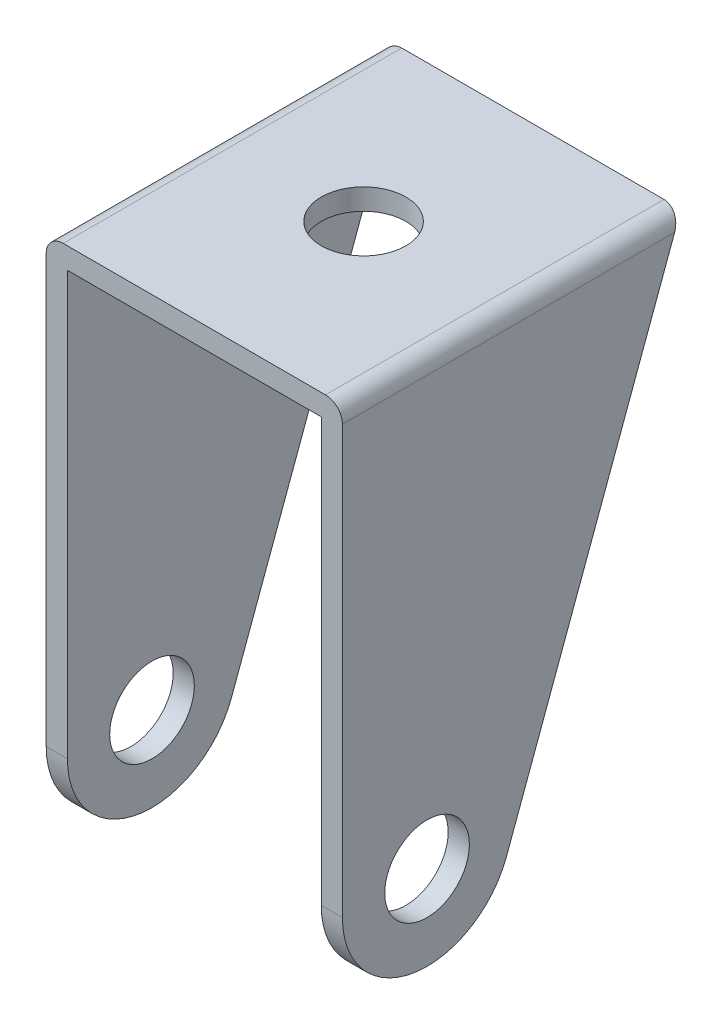
ISO-10303-21;
HEADER;
FILE_DESCRIPTION(('STEP AP214'),'2;1');
FILE_NAME('part.step','',(''),(''),'','','');
FILE_SCHEMA(('AUTOMOTIVE_DESIGN { 1 0 10303 214 1 1 1 1 }'));
ENDSEC;
DATA;
#1=APPLICATION_CONTEXT('core data for automotive mechanical design processes');
#2=APPLICATION_PROTOCOL_DEFINITION('international standard','automotive_design',2000,#1);
#3=PRODUCT_CONTEXT('',#1,'mechanical');
#4=PRODUCT('Part','Part','',(#3));
#5=PRODUCT_RELATED_PRODUCT_CATEGORY('part','',(#4));
#6=PRODUCT_DEFINITION_FORMATION('','',#4);
#7=PRODUCT_DEFINITION_CONTEXT('part definition',#1,'design');
#8=PRODUCT_DEFINITION('design','',#6,#7);
#9=PRODUCT_DEFINITION_SHAPE('','',#8);
#10=(LENGTH_UNIT() NAMED_UNIT(*) SI_UNIT(.MILLI.,.METRE.));
#11=(NAMED_UNIT(*) PLANE_ANGLE_UNIT() SI_UNIT($,.RADIAN.));
#12=(NAMED_UNIT(*) SI_UNIT($,.STERADIAN.) SOLID_ANGLE_UNIT());
#13=UNCERTAINTY_MEASURE_WITH_UNIT(LENGTH_MEASURE(1.E-05),#10,'distance_accuracy_value','');
#14=(GEOMETRIC_REPRESENTATION_CONTEXT(3) GLOBAL_UNCERTAINTY_ASSIGNED_CONTEXT((#13)) GLOBAL_UNIT_ASSIGNED_CONTEXT((#10,
#11,#12)) REPRESENTATION_CONTEXT('',''));
#15=CARTESIAN_POINT('',(0.,0.,0.));
#16=DIRECTION('',(0.,0.,1.));
#17=DIRECTION('',(1.,0.,0.));
#18=AXIS2_PLACEMENT_3D('',#15,#16,#17);
#19=CARTESIAN_POINT('',(0.,0.,50.8));
#20=DIRECTION('',(-1.,0.,0.));
#21=DIRECTION('',(0.,0.,1.));
#22=AXIS2_PLACEMENT_3D('',#19,#20,#21);
#23=PLANE('',#22);
#24=CARTESIAN_POINT('',(0.,12.7,38.1));
#25=DIRECTION('',(-1.,0.,0.));
#26=DIRECTION('',(0.,0.,1.));
#27=AXIS2_PLACEMENT_3D('',#24,#25,#26);
#28=CIRCLE('',#27,6.35);
#29=CARTESIAN_POINT('',(0.,12.7,44.45));
#30=VERTEX_POINT('',#29);
#31=EDGE_CURVE('E158',#30,#30,#28,.T.);
#32=ORIENTED_EDGE('',*,*,#31,.T.);
#33=EDGE_LOOP('',(#32));
#34=FACE_BOUND('',#33,.T.);
#35=CARTESIAN_POINT('',(0.,12.7,38.1));
#36=DIRECTION('',(-1.,0.,0.));
#37=DIRECTION('',(0.,0.,1.));
#38=AXIS2_PLACEMENT_3D('',#35,#36,#37);
#39=CIRCLE('',#38,12.7);
#40=CARTESIAN_POINT('',(0.,12.7,50.8));
#41=VERTEX_POINT('',#40);
#42=CARTESIAN_POINT('',(0.,8.30938963643764,26.1830985304325));
#43=VERTEX_POINT('',#42);
#44=EDGE_CURVE('E190',#41,#43,#39,.F.);
#45=ORIENTED_EDGE('',*,*,#44,.T.);
#46=DIRECTION('',(0.,0.938338698391138,-0.345717351461603));
#47=VECTOR('',#46,1.);
#48=CARTESIAN_POINT('',(0.,-6.99257979105945,31.8208883303109));
#49=LINE('',#48,#47);
#50=CARTESIAN_POINT('',(0.,76.2,1.1697829288855));
#51=VERTEX_POINT('',#50);
#52=EDGE_CURVE('E176',#43,#51,#49,.T.);
#53=ORIENTED_EDGE('',*,*,#52,.T.);
#54=DIRECTION('',(0.,0.,-1.));
#55=VECTOR('',#54,1.);
#56=CARTESIAN_POINT('',(0.,76.2,50.8));
#57=LINE('',#56,#55);
#58=CARTESIAN_POINT('',(0.,76.2,50.8));
#59=VERTEX_POINT('',#58);
#60=EDGE_CURVE('E210',#59,#51,#57,.T.);
#61=ORIENTED_EDGE('',*,*,#60,.F.);
#62=DIRECTION('',(0.,1.,0.));
#63=VECTOR('',#62,1.);
#64=CARTESIAN_POINT('',(0.,0.,50.8));
#65=LINE('',#64,#63);
#66=EDGE_CURVE('E193',#41,#59,#65,.T.);
#67=ORIENTED_EDGE('',*,*,#66,.F.);
#68=EDGE_LOOP('',(#45,#53,#61,#67));
#69=FACE_BOUND('',#68,.T.);
#70=ADVANCED_FACE('F63',(#34,#69),#23,.F.);
#71=CARTESIAN_POINT('',(38.1,76.2,50.8));
#72=DIRECTION('',(1.,0.,0.));
#73=DIRECTION('',(0.,1.,0.));
#74=AXIS2_PLACEMENT_3D('',#71,#72,#73);
#75=PLANE('',#74);
#76=CARTESIAN_POINT('',(38.1,12.7,38.1));
#77=DIRECTION('',(1.,0.,0.));
#78=DIRECTION('',(0.,1.,0.));
#79=AXIS2_PLACEMENT_3D('',#76,#77,#78);
#80=CIRCLE('',#79,6.35);
#81=CARTESIAN_POINT('',(38.1,19.05,38.1));
#82=VERTEX_POINT('',#81);
#83=EDGE_CURVE('E182',#82,#82,#80,.T.);
#84=ORIENTED_EDGE('',*,*,#83,.T.);
#85=EDGE_LOOP('',(#84));
#86=FACE_BOUND('',#85,.T.);
#87=DIRECTION('',(0.,0.,-1.));
#88=VECTOR('',#87,1.);
#89=CARTESIAN_POINT('',(38.1,76.2,50.8));
#90=LINE('',#89,#88);
#91=CARTESIAN_POINT('',(38.1,76.2,50.8));
#92=VERTEX_POINT('',#91);
#93=CARTESIAN_POINT('',(38.1,76.2,1.1697829288855));
#94=VERTEX_POINT('',#93);
#95=EDGE_CURVE('E205',#92,#94,#90,.T.);
#96=ORIENTED_EDGE('',*,*,#95,.T.);
#97=DIRECTION('',(0.,-0.938338698391138,0.345717351461603));
#98=VECTOR('',#97,1.);
#99=CARTESIAN_POINT('',(38.1,60.0999590917967,7.10161064818449));
#100=LINE('',#99,#98);
#101=CARTESIAN_POINT('',(38.1,8.30938963643765,26.1830985304325));
#102=VERTEX_POINT('',#101);
#103=EDGE_CURVE('E174',#94,#102,#100,.T.);
#104=ORIENTED_EDGE('',*,*,#103,.T.);
#105=CARTESIAN_POINT('',(38.1,12.7,38.1));
#106=DIRECTION('',(1.,0.,0.));
#107=DIRECTION('',(0.,1.,0.));
#108=AXIS2_PLACEMENT_3D('',#105,#106,#107);
#109=CIRCLE('',#108,12.7);
#110=CARTESIAN_POINT('',(38.1,12.7,50.8));
#111=VERTEX_POINT('',#110);
#112=EDGE_CURVE('E162',#102,#111,#109,.F.);
#113=ORIENTED_EDGE('',*,*,#112,.T.);
#114=DIRECTION('',(0.,-1.,0.));
#115=VECTOR('',#114,1.);
#116=CARTESIAN_POINT('',(38.1,76.2,50.8));
#117=LINE('',#116,#115);
#118=EDGE_CURVE('E197',#92,#111,#117,.T.);
#119=ORIENTED_EDGE('',*,*,#118,.F.);
#120=EDGE_LOOP('',(#96,#104,#113,#119));
#121=FACE_BOUND('',#120,.T.);
#122=ADVANCED_FACE('F250',(#86,#121),#75,.F.);
#123=CARTESIAN_POINT('',(41.275,79.375,50.8));
#124=DIRECTION('',(-1.,0.,0.));
#125=DIRECTION('',(0.,-1.,0.));
#126=AXIS2_PLACEMENT_3D('',#123,#124,#125);
#127=PLANE('',#126);
#128=CARTESIAN_POINT('',(41.275,12.7,38.1));
#129=DIRECTION('',(1.,0.,0.));
#130=DIRECTION('',(0.,1.,0.));
#131=AXIS2_PLACEMENT_3D('',#128,#129,#130);
#132=CIRCLE('',#131,6.35);
#133=CARTESIAN_POINT('',(41.275,19.05,38.1));
#134=VERTEX_POINT('',#133);
#135=EDGE_CURVE('E166',#134,#134,#132,.T.);
#136=ORIENTED_EDGE('',*,*,#135,.F.);
#137=EDGE_LOOP('',(#136));
#138=FACE_BOUND('',#137,.T.);
#139=DIRECTION('',(0.,-0.938338698391138,0.345717351461603));
#140=VECTOR('',#139,1.);
#141=CARTESIAN_POINT('',(41.275,9.48693866369151,25.7492475855484));
#142=LINE('',#141,#140);
#143=CARTESIAN_POINT('',(41.275,76.835,0.935826343108383));
#144=VERTEX_POINT('',#143);
#145=CARTESIAN_POINT('',(41.275,8.30938963643765,26.1830985304325));
#146=VERTEX_POINT('',#145);
#147=EDGE_CURVE('E142',#144,#146,#142,.T.);
#148=ORIENTED_EDGE('',*,*,#147,.F.);
#149=DIRECTION('',(0.,0.,-1.));
#150=VECTOR('',#149,1.);
#151=CARTESIAN_POINT('',(41.275,76.835,50.8));
#152=LINE('',#151,#150);
#153=CARTESIAN_POINT('',(41.275,76.835,50.8));
#154=VERTEX_POINT('',#153);
#155=EDGE_CURVE('E86',#144,#154,#152,.F.);
#156=ORIENTED_EDGE('',*,*,#155,.T.);
#157=DIRECTION('',(0.,1.,0.));
#158=VECTOR('',#157,1.);
#159=CARTESIAN_POINT('',(41.275,79.375,50.8));
#160=LINE('',#159,#158);
#161=CARTESIAN_POINT('',(41.275,12.7,50.8));
#162=VERTEX_POINT('',#161);
#163=EDGE_CURVE('E154',#162,#154,#160,.T.);
#164=ORIENTED_EDGE('',*,*,#163,.F.);
#165=CARTESIAN_POINT('',(41.275,12.7,38.1));
#166=DIRECTION('',(1.,0.,0.));
#167=DIRECTION('',(0.,1.,0.));
#168=AXIS2_PLACEMENT_3D('',#165,#166,#167);
#169=CIRCLE('',#168,12.7);
#170=EDGE_CURVE('E152',#146,#162,#169,.F.);
#171=ORIENTED_EDGE('',*,*,#170,.F.);
#172=EDGE_LOOP('',(#148,#156,#164,#171));
#173=FACE_BOUND('',#172,.T.);
#174=ADVANCED_FACE('F153',(#138,#173),#127,.F.);
#175=CARTESIAN_POINT('',(-3.175,0.,50.8));
#176=DIRECTION('',(1.,0.,0.));
#177=DIRECTION('',(0.,0.,-1.));
#178=AXIS2_PLACEMENT_3D('',#175,#176,#177);
#179=PLANE('',#178);
#180=CARTESIAN_POINT('',(-3.175,12.7,38.1));
#181=DIRECTION('',(1.,0.,0.));
#182=DIRECTION('',(0.,0.,-1.));
#183=AXIS2_PLACEMENT_3D('',#180,#181,#182);
#184=CIRCLE('',#183,6.35);
#185=CARTESIAN_POINT('',(-3.175,12.7,31.75));
#186=VERTEX_POINT('',#185);
#187=EDGE_CURVE('E181',#186,#186,#184,.T.);
#188=ORIENTED_EDGE('',*,*,#187,.T.);
#189=EDGE_LOOP('',(#188));
#190=FACE_BOUND('',#189,.T.);
#191=DIRECTION('',(0.,-1.,0.));
#192=VECTOR('',#191,1.);
#193=CARTESIAN_POINT('',(-3.175,0.,50.8));
#194=LINE('',#193,#192);
#195=CARTESIAN_POINT('',(-3.175,76.835,50.8));
#196=VERTEX_POINT('',#195);
#197=CARTESIAN_POINT('',(-3.175,12.7,50.8));
#198=VERTEX_POINT('',#197);
#199=EDGE_CURVE('E203',#196,#198,#194,.T.);
#200=ORIENTED_EDGE('',*,*,#199,.F.);
#201=DIRECTION('',(0.,0.,-1.));
#202=VECTOR('',#201,1.);
#203=CARTESIAN_POINT('',(-3.175,76.835,50.8));
#204=LINE('',#203,#202);
#205=CARTESIAN_POINT('',(-3.175,76.835,0.935826343108386));
#206=VERTEX_POINT('',#205);
#207=EDGE_CURVE('E12',#196,#206,#204,.T.);
#208=ORIENTED_EDGE('',*,*,#207,.T.);
#209=DIRECTION('',(0.,-0.938338698391138,0.345717351461603));
#210=VECTOR('',#209,1.);
#211=CARTESIAN_POINT('',(-3.175,-6.99257979105945,31.8208883303109));
#212=LINE('',#211,#210);
#213=CARTESIAN_POINT('',(-3.175,8.30938963643764,26.1830985304325));
#214=VERTEX_POINT('',#213);
#215=EDGE_CURVE('E179',#206,#214,#212,.T.);
#216=ORIENTED_EDGE('',*,*,#215,.T.);
#217=CARTESIAN_POINT('',(-3.175,12.7,38.1));
#218=DIRECTION('',(1.,0.,0.));
#219=DIRECTION('',(0.,0.,-1.));
#220=AXIS2_PLACEMENT_3D('',#217,#218,#219);
#221=CIRCLE('',#220,12.7);
#222=EDGE_CURVE('E157',#214,#198,#221,.F.);
#223=ORIENTED_EDGE('',*,*,#222,.T.);
#224=EDGE_LOOP('',(#200,#208,#216,#223));
#225=FACE_BOUND('',#224,.T.);
#226=ADVANCED_FACE('F265',(#190,#225),#179,.F.);
#227=CARTESIAN_POINT('',(0.,0.,50.8));
#228=DIRECTION('',(0.,0.,-1.));
#229=DIRECTION('',(-1.,0.,0.));
#230=AXIS2_PLACEMENT_3D('',#227,#228,#229);
#231=PLANE('',#230);
#232=ORIENTED_EDGE('',*,*,#163,.T.);
#233=CARTESIAN_POINT('',(38.735,76.835,50.8));
#234=DIRECTION('',(0.,0.,-1.));
#235=DIRECTION('',(-1.,0.,0.));
#236=AXIS2_PLACEMENT_3D('',#233,#234,#235);
#237=CIRCLE('',#236,2.54);
#238=CARTESIAN_POINT('',(38.735,79.375,50.8));
#239=VERTEX_POINT('',#238);
#240=EDGE_CURVE('E71',#154,#239,#237,.F.);
#241=ORIENTED_EDGE('',*,*,#240,.T.);
#242=DIRECTION('',(-1.,0.,0.));
#243=VECTOR('',#242,1.);
#244=CARTESIAN_POINT('',(-3.175,79.375,50.8));
#245=LINE('',#244,#243);
#246=CARTESIAN_POINT('',(-0.635,79.375,50.8));
#247=VERTEX_POINT('',#246);
#248=EDGE_CURVE('E201',#239,#247,#245,.T.);
#249=ORIENTED_EDGE('',*,*,#248,.T.);
#250=CARTESIAN_POINT('',(-0.635,76.835,50.8));
#251=DIRECTION('',(0.,0.,-1.));
#252=DIRECTION('',(-1.,0.,0.));
#253=AXIS2_PLACEMENT_3D('',#250,#251,#252);
#254=CIRCLE('',#253,2.54);
#255=EDGE_CURVE('E78',#247,#196,#254,.F.);
#256=ORIENTED_EDGE('',*,*,#255,.T.);
#257=ORIENTED_EDGE('',*,*,#199,.T.);
#258=DIRECTION('',(1.,0.,0.));
#259=VECTOR('',#258,1.);
#260=CARTESIAN_POINT('',(-9.52499999999999,12.7,50.8));
#261=LINE('',#260,#259);
#262=EDGE_CURVE('E213',#41,#198,#261,.F.);
#263=ORIENTED_EDGE('',*,*,#262,.F.);
#264=ORIENTED_EDGE('',*,*,#66,.T.);
#265=DIRECTION('',(1.,0.,0.));
#266=VECTOR('',#265,1.);
#267=CARTESIAN_POINT('',(0.,76.2,50.8));
#268=LINE('',#267,#266);
#269=EDGE_CURVE('E195',#59,#92,#268,.T.);
#270=ORIENTED_EDGE('',*,*,#269,.T.);
#271=ORIENTED_EDGE('',*,*,#118,.T.);
#272=EDGE_CURVE('E216',#162,#111,#261,.F.);
#273=ORIENTED_EDGE('',*,*,#272,.F.);
#274=EDGE_LOOP('',(#232,#241,#249,#256,#257,#263,#264,#270,#271,#273));
#275=FACE_BOUND('',#274,.T.);
#276=ADVANCED_FACE('F230',(#275),#231,.F.);
#277=CARTESIAN_POINT('',(0.,76.2,50.8));
#278=DIRECTION('',(0.,1.,0.));
#279=DIRECTION('',(0.,0.,1.));
#280=AXIS2_PLACEMENT_3D('',#277,#278,#279);
#281=PLANE('',#280);
#282=CARTESIAN_POINT('',(19.05,76.2,25.4));
#283=DIRECTION('',(0.,1.,0.));
#284=DIRECTION('',(0.,0.,1.));
#285=AXIS2_PLACEMENT_3D('',#282,#283,#284);
#286=CIRCLE('',#285,6.35);
#287=CARTESIAN_POINT('',(19.05,76.2,31.75));
#288=VERTEX_POINT('',#287);
#289=EDGE_CURVE('E150',#288,#288,#286,.T.);
#290=ORIENTED_EDGE('',*,*,#289,.T.);
#291=EDGE_LOOP('',(#290));
#292=FACE_BOUND('',#291,.T.);
#293=ORIENTED_EDGE('',*,*,#60,.T.);
#294=DIRECTION('',(1.,0.,0.));
#295=VECTOR('',#294,1.);
#296=CARTESIAN_POINT('',(0.,76.2,1.1697829288855));
#297=LINE('',#296,#295);
#298=EDGE_CURVE('E171',#51,#94,#297,.T.);
#299=ORIENTED_EDGE('',*,*,#298,.T.);
#300=ORIENTED_EDGE('',*,*,#95,.F.);
#301=ORIENTED_EDGE('',*,*,#269,.F.);
#302=EDGE_LOOP('',(#293,#299,#300,#301));
#303=FACE_BOUND('',#302,.T.);
#304=ADVANCED_FACE('F259',(#292,#303),#281,.F.);
#305=CARTESIAN_POINT('',(-3.175,79.375,50.8));
#306=DIRECTION('',(0.,-1.,0.));
#307=DIRECTION('',(0.,0.,-1.));
#308=AXIS2_PLACEMENT_3D('',#305,#306,#307);
#309=PLANE('',#308);
#310=CARTESIAN_POINT('',(19.05,79.375,25.4));
#311=DIRECTION('',(0.,1.,0.));
#312=DIRECTION('',(0.,0.,1.));
#313=AXIS2_PLACEMENT_3D('',#310,#311,#312);
#314=CIRCLE('',#313,6.35);
#315=CARTESIAN_POINT('',(19.05,79.375,31.75));
#316=VERTEX_POINT('',#315);
#317=EDGE_CURVE('E292',#316,#316,#314,.T.);
#318=ORIENTED_EDGE('',*,*,#317,.F.);
#319=EDGE_LOOP('',(#318));
#320=FACE_BOUND('',#319,.T.);
#321=ORIENTED_EDGE('',*,*,#248,.F.);
#322=DIRECTION('',(0.,0.,-1.));
#323=VECTOR('',#322,1.);
#324=CARTESIAN_POINT('',(38.735,79.375,50.8));
#325=LINE('',#324,#323);
#326=CARTESIAN_POINT('',(38.735,79.375,0.));
#327=VERTEX_POINT('',#326);
#328=EDGE_CURVE('E221',#239,#327,#325,.T.);
#329=ORIENTED_EDGE('',*,*,#328,.T.);
#330=DIRECTION('',(-1.,0.,0.));
#331=VECTOR('',#330,1.);
#332=CARTESIAN_POINT('',(-3.175,79.375,0.));
#333=LINE('',#332,#331);
#334=CARTESIAN_POINT('',(-0.635,79.375,0.));
#335=VERTEX_POINT('',#334);
#336=EDGE_CURVE('E192',#327,#335,#333,.T.);
#337=ORIENTED_EDGE('',*,*,#336,.T.);
#338=DIRECTION('',(0.,0.,-1.));
#339=VECTOR('',#338,1.);
#340=CARTESIAN_POINT('',(-0.635,79.375,50.8));
#341=LINE('',#340,#339);
#342=EDGE_CURVE('E219',#335,#247,#341,.F.);
#343=ORIENTED_EDGE('',*,*,#342,.T.);
#344=EDGE_LOOP('',(#321,#329,#337,#343));
#345=FACE_BOUND('',#344,.T.);
#346=ADVANCED_FACE('F234',(#320,#345),#309,.F.);
#347=CARTESIAN_POINT('',(-9.52499999999999,12.7,38.1));
#348=DIRECTION('',(1.,0.,0.));
#349=DIRECTION('',(0.,1.,0.));
#350=AXIS2_PLACEMENT_3D('',#347,#348,#349);
#351=CYLINDRICAL_SURFACE('',#350,12.7);
#352=ORIENTED_EDGE('',*,*,#262,.T.);
#353=ORIENTED_EDGE('',*,*,#222,.F.);
#354=DIRECTION('',(1.,0.,0.));
#355=VECTOR('',#354,1.);
#356=CARTESIAN_POINT('',(-9.52499999999999,8.30938963643764,26.1830985304325));
#357=LINE('',#356,#355);
#358=EDGE_CURVE('E163',#214,#43,#357,.T.);
#359=ORIENTED_EDGE('',*,*,#358,.T.);
#360=ORIENTED_EDGE('',*,*,#44,.F.);
#361=EDGE_LOOP('',(#352,#353,#359,#360));
#362=FACE_BOUND('',#361,.T.);
#363=ADVANCED_FACE('F269',(#362),#351,.T.);
#364=ORIENTED_EDGE('',*,*,#112,.F.);
#365=EDGE_CURVE('E147',#102,#146,#357,.T.);
#366=ORIENTED_EDGE('',*,*,#365,.T.);
#367=ORIENTED_EDGE('',*,*,#170,.T.);
#368=ORIENTED_EDGE('',*,*,#272,.T.);
#369=EDGE_LOOP('',(#364,#366,#367,#368));
#370=FACE_BOUND('',#369,.T.);
#371=ADVANCED_FACE('F160',(#370),#351,.T.);
#372=CARTESIAN_POINT('',(-9.52499999999999,9.4869386636915,25.7492475855484));
#373=DIRECTION('',(0.,0.345717351461603,0.938338698391138));
#374=DIRECTION('',(0.,-0.938338698391138,0.345717351461603));
#375=AXIS2_PLACEMENT_3D('',#372,#373,#374);
#376=PLANE('',#375);
#377=ORIENTED_EDGE('',*,*,#336,.F.);
#378=CARTESIAN_POINT('',(38.735,76.835,0.935826343108397));
#379=DIRECTION('',(0.,0.345717351461603,0.938338698391138));
#380=DIRECTION('',(0.,0.938338698391138,-0.345717351461603));
#381=AXIS2_PLACEMENT_3D('',#378,#379,#380);
#382=ELLIPSE('',#381,2.70691169868092,2.54);
#383=EDGE_CURVE('E149',#327,#144,#382,.F.);
#384=ORIENTED_EDGE('',*,*,#383,.T.);
#385=ORIENTED_EDGE('',*,*,#147,.T.);
#386=ORIENTED_EDGE('',*,*,#365,.F.);
#387=ORIENTED_EDGE('',*,*,#103,.F.);
#388=ORIENTED_EDGE('',*,*,#298,.F.);
#389=ORIENTED_EDGE('',*,*,#52,.F.);
#390=ORIENTED_EDGE('',*,*,#358,.F.);
#391=ORIENTED_EDGE('',*,*,#215,.F.);
#392=CARTESIAN_POINT('',(-0.635,76.835,0.935826343108397));
#393=DIRECTION('',(0.,0.345717351461603,0.938338698391138));
#394=DIRECTION('',(0.,0.938338698391138,-0.345717351461603));
#395=AXIS2_PLACEMENT_3D('',#392,#393,#394);
#396=ELLIPSE('',#395,2.70691169868092,2.54);
#397=EDGE_CURVE('E224',#206,#335,#396,.F.);
#398=ORIENTED_EDGE('',*,*,#397,.T.);
#399=EDGE_LOOP('',(#377,#384,#385,#386,#387,#388,#389,#390,#391,#398));
#400=FACE_BOUND('',#399,.T.);
#401=ADVANCED_FACE('F145',(#400),#376,.F.);
#402=CARTESIAN_POINT('',(-9.52499999999999,12.7,38.1));
#403=DIRECTION('',(1.,0.,0.));
#404=DIRECTION('',(0.,1.,0.));
#405=AXIS2_PLACEMENT_3D('',#402,#403,#404);
#406=CYLINDRICAL_SURFACE('',#405,6.35);
#407=ORIENTED_EDGE('',*,*,#187,.F.);
#408=EDGE_LOOP('',(#407));
#409=FACE_BOUND('',#408,.T.);
#410=ORIENTED_EDGE('',*,*,#31,.F.);
#411=EDGE_LOOP('',(#410));
#412=FACE_BOUND('',#411,.T.);
#413=ADVANCED_FACE('F245',(#409,#412),#406,.F.);
#414=ORIENTED_EDGE('',*,*,#135,.T.);
#415=EDGE_LOOP('',(#414));
#416=FACE_BOUND('',#415,.T.);
#417=ORIENTED_EDGE('',*,*,#83,.F.);
#418=EDGE_LOOP('',(#417));
#419=FACE_BOUND('',#418,.T.);
#420=ADVANCED_FACE('F238',(#416,#419),#406,.F.);
#421=CARTESIAN_POINT('',(38.735,76.835,50.8));
#422=DIRECTION('',(0.,0.,-1.));
#423=DIRECTION('',(-1.,0.,0.));
#424=AXIS2_PLACEMENT_3D('',#421,#422,#423);
#425=CYLINDRICAL_SURFACE('',#424,2.54);
#426=ORIENTED_EDGE('',*,*,#240,.F.);
#427=ORIENTED_EDGE('',*,*,#155,.F.);
#428=ORIENTED_EDGE('',*,*,#383,.F.);
#429=ORIENTED_EDGE('',*,*,#328,.F.);
#430=EDGE_LOOP('',(#426,#427,#428,#429));
#431=FACE_BOUND('',#430,.T.);
#432=ADVANCED_FACE('F236',(#431),#425,.T.);
#433=CARTESIAN_POINT('',(-0.635,76.835,50.8));
#434=DIRECTION('',(0.,0.,-1.));
#435=DIRECTION('',(-1.,0.,0.));
#436=AXIS2_PLACEMENT_3D('',#433,#434,#435);
#437=CYLINDRICAL_SURFACE('',#436,2.54);
#438=ORIENTED_EDGE('',*,*,#255,.F.);
#439=ORIENTED_EDGE('',*,*,#342,.F.);
#440=ORIENTED_EDGE('',*,*,#397,.F.);
#441=ORIENTED_EDGE('',*,*,#207,.F.);
#442=EDGE_LOOP('',(#438,#439,#440,#441));
#443=FACE_BOUND('',#442,.T.);
#444=ADVANCED_FACE('F65',(#443),#437,.T.);
#445=CARTESIAN_POINT('',(19.05,76.2,25.4));
#446=DIRECTION('',(0.,1.,0.));
#447=DIRECTION('',(0.,0.,1.));
#448=AXIS2_PLACEMENT_3D('',#445,#446,#447);
#449=CYLINDRICAL_SURFACE('',#448,6.35);
#450=ORIENTED_EDGE('',*,*,#289,.F.);
#451=EDGE_LOOP('',(#450));
#452=FACE_BOUND('',#451,.T.);
#453=ORIENTED_EDGE('',*,*,#317,.T.);
#454=EDGE_LOOP('',(#453));
#455=FACE_BOUND('',#454,.T.);
#456=ADVANCED_FACE('F243',(#452,#455),#449,.F.);
#457=CLOSED_SHELL('',(#70,#122,#174,#226,#276,#304,#346,#363,#371,#401,#413,#420,#432,#444,#456));
#458=MANIFOLD_SOLID_BREP('B2',#457);
#459=ADVANCED_BREP_SHAPE_REPRESENTATION('',(#18,#458),#14);
#460=SHAPE_DEFINITION_REPRESENTATION(#9,#459);
ENDSEC;
END-ISO-10303-21;
